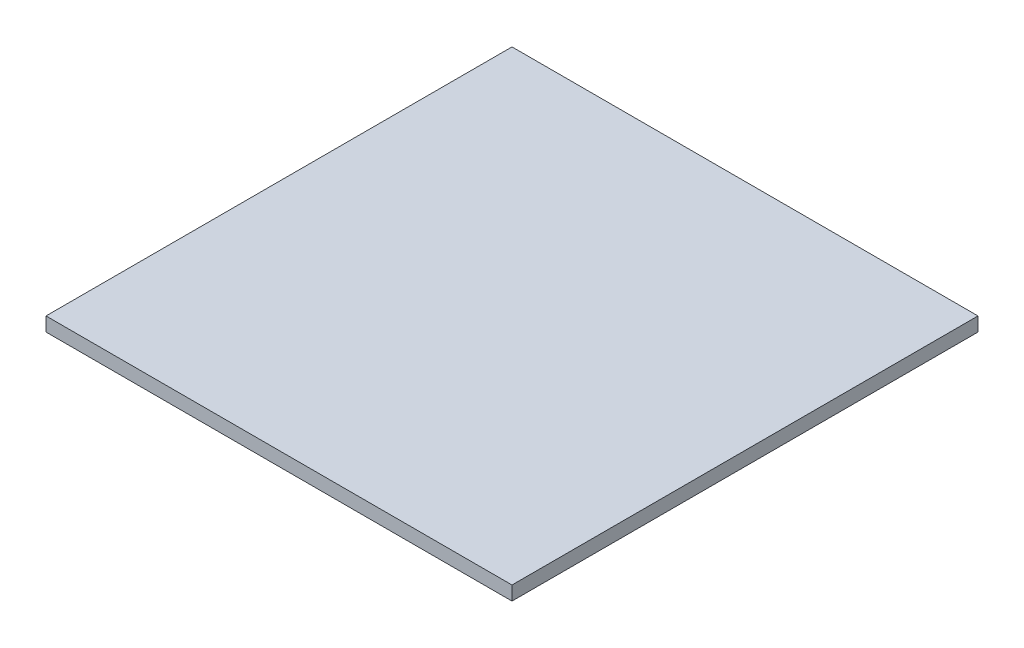
ISO-10303-21;
HEADER;
FILE_DESCRIPTION(('STEP AP214'),'2;1');
FILE_NAME('part.step','',(''),(''),'','','');
FILE_SCHEMA(('AUTOMOTIVE_DESIGN { 1 0 10303 214 1 1 1 1 }'));
ENDSEC;
DATA;
#1=APPLICATION_CONTEXT('core data for automotive mechanical design processes');
#2=APPLICATION_PROTOCOL_DEFINITION('international standard','automotive_design',2000,#1);
#3=PRODUCT_CONTEXT('',#1,'mechanical');
#4=PRODUCT('Part','Part','',(#3));
#5=PRODUCT_RELATED_PRODUCT_CATEGORY('part','',(#4));
#6=PRODUCT_DEFINITION_FORMATION('','',#4);
#7=PRODUCT_DEFINITION_CONTEXT('part definition',#1,'design');
#8=PRODUCT_DEFINITION('design','',#6,#7);
#9=PRODUCT_DEFINITION_SHAPE('','',#8);
#10=(LENGTH_UNIT() NAMED_UNIT(*) SI_UNIT(.MILLI.,.METRE.));
#11=(NAMED_UNIT(*) PLANE_ANGLE_UNIT() SI_UNIT($,.RADIAN.));
#12=(NAMED_UNIT(*) SI_UNIT($,.STERADIAN.) SOLID_ANGLE_UNIT());
#13=UNCERTAINTY_MEASURE_WITH_UNIT(LENGTH_MEASURE(1.E-05),#10,'distance_accuracy_value','');
#14=(GEOMETRIC_REPRESENTATION_CONTEXT(3) GLOBAL_UNCERTAINTY_ASSIGNED_CONTEXT((#13)) GLOBAL_UNIT_ASSIGNED_CONTEXT((#10,
#11,#12)) REPRESENTATION_CONTEXT('',''));
#15=CARTESIAN_POINT('',(0.,0.,0.));
#16=DIRECTION('',(0.,0.,1.));
#17=DIRECTION('',(1.,0.,0.));
#18=AXIS2_PLACEMENT_3D('',#15,#16,#17);
#19=CARTESIAN_POINT('',(-50.,3.,50.));
#20=DIRECTION('',(1.,0.,0.));
#21=DIRECTION('',(0.,0.,-1.));
#22=AXIS2_PLACEMENT_3D('',#19,#20,#21);
#23=PLANE('',#22);
#24=DIRECTION('',(0.,0.,1.));
#25=VECTOR('',#24,1.);
#26=CARTESIAN_POINT('',(-50.,0.,50.));
#27=LINE('',#26,#25);
#28=CARTESIAN_POINT('',(-50.,0.,-50.));
#29=VERTEX_POINT('',#28);
#30=CARTESIAN_POINT('',(-50.,0.,50.));
#31=VERTEX_POINT('',#30);
#32=EDGE_CURVE('E100',#29,#31,#27,.T.);
#33=ORIENTED_EDGE('',*,*,#32,.T.);
#34=DIRECTION('',(0.,-1.,0.));
#35=VECTOR('',#34,1.);
#36=CARTESIAN_POINT('',(-50.,3.,50.));
#37=LINE('',#36,#35);
#38=CARTESIAN_POINT('',(-50.,3.,50.));
#39=VERTEX_POINT('',#38);
#40=EDGE_CURVE('E11',#39,#31,#37,.T.);
#41=ORIENTED_EDGE('',*,*,#40,.F.);
#42=DIRECTION('',(0.,0.,1.));
#43=VECTOR('',#42,1.);
#44=CARTESIAN_POINT('',(-50.,3.,50.));
#45=LINE('',#44,#43);
#46=CARTESIAN_POINT('',(-50.,3.,-50.));
#47=VERTEX_POINT('',#46);
#48=EDGE_CURVE('E88',#47,#39,#45,.T.);
#49=ORIENTED_EDGE('',*,*,#48,.F.);
#50=DIRECTION('',(0.,-1.,0.));
#51=VECTOR('',#50,1.);
#52=CARTESIAN_POINT('',(-50.,3.,-50.));
#53=LINE('',#52,#51);
#54=EDGE_CURVE('E96',#47,#29,#53,.T.);
#55=ORIENTED_EDGE('',*,*,#54,.T.);
#56=EDGE_LOOP('',(#33,#41,#49,#55));
#57=FACE_BOUND('',#56,.T.);
#58=ADVANCED_FACE('F37',(#57),#23,.F.);
#59=CARTESIAN_POINT('',(50.,3.,50.));
#60=DIRECTION('',(0.,0.,-1.));
#61=DIRECTION('',(-1.,0.,0.));
#62=AXIS2_PLACEMENT_3D('',#59,#60,#61);
#63=PLANE('',#62);
#64=DIRECTION('',(1.,0.,0.));
#65=VECTOR('',#64,1.);
#66=CARTESIAN_POINT('',(50.,0.,50.));
#67=LINE('',#66,#65);
#68=CARTESIAN_POINT('',(50.,0.,50.));
#69=VERTEX_POINT('',#68);
#70=EDGE_CURVE('E92',#31,#69,#67,.T.);
#71=ORIENTED_EDGE('',*,*,#70,.T.);
#72=DIRECTION('',(0.,-1.,0.));
#73=VECTOR('',#72,1.);
#74=CARTESIAN_POINT('',(50.,3.,50.));
#75=LINE('',#74,#73);
#76=CARTESIAN_POINT('',(50.,3.,50.));
#77=VERTEX_POINT('',#76);
#78=EDGE_CURVE('E45',#77,#69,#75,.T.);
#79=ORIENTED_EDGE('',*,*,#78,.F.);
#80=DIRECTION('',(1.,0.,0.));
#81=VECTOR('',#80,1.);
#82=CARTESIAN_POINT('',(50.,3.,50.));
#83=LINE('',#82,#81);
#84=EDGE_CURVE('E83',#39,#77,#83,.T.);
#85=ORIENTED_EDGE('',*,*,#84,.F.);
#86=ORIENTED_EDGE('',*,*,#40,.T.);
#87=EDGE_LOOP('',(#71,#79,#85,#86));
#88=FACE_BOUND('',#87,.T.);
#89=ADVANCED_FACE('F91',(#88),#63,.F.);
#90=CARTESIAN_POINT('',(50.,3.,50.));
#91=DIRECTION('',(-1.,0.,0.));
#92=DIRECTION('',(0.,0.,1.));
#93=AXIS2_PLACEMENT_3D('',#90,#91,#92);
#94=PLANE('',#93);
#95=DIRECTION('',(0.,0.,-1.));
#96=VECTOR('',#95,1.);
#97=CARTESIAN_POINT('',(50.,0.,50.));
#98=LINE('',#97,#96);
#99=CARTESIAN_POINT('',(50.,0.,-50.));
#100=VERTEX_POINT('',#99);
#101=EDGE_CURVE('E70',#69,#100,#98,.T.);
#102=ORIENTED_EDGE('',*,*,#101,.T.);
#103=DIRECTION('',(0.,-1.,0.));
#104=VECTOR('',#103,1.);
#105=CARTESIAN_POINT('',(50.,3.,-50.));
#106=LINE('',#105,#104);
#107=CARTESIAN_POINT('',(50.,3.,-50.));
#108=VERTEX_POINT('',#107);
#109=EDGE_CURVE('E93',#108,#100,#106,.T.);
#110=ORIENTED_EDGE('',*,*,#109,.F.);
#111=DIRECTION('',(0.,0.,-1.));
#112=VECTOR('',#111,1.);
#113=CARTESIAN_POINT('',(50.,3.,50.));
#114=LINE('',#113,#112);
#115=EDGE_CURVE('E86',#77,#108,#114,.T.);
#116=ORIENTED_EDGE('',*,*,#115,.F.);
#117=ORIENTED_EDGE('',*,*,#78,.T.);
#118=EDGE_LOOP('',(#102,#110,#116,#117));
#119=FACE_BOUND('',#118,.T.);
#120=ADVANCED_FACE('F94',(#119),#94,.F.);
#121=CARTESIAN_POINT('',(50.,3.,-50.));
#122=DIRECTION('',(0.,0.,1.));
#123=DIRECTION('',(1.,0.,0.));
#124=AXIS2_PLACEMENT_3D('',#121,#122,#123);
#125=PLANE('',#124);
#126=DIRECTION('',(-1.,0.,0.));
#127=VECTOR('',#126,1.);
#128=CARTESIAN_POINT('',(50.,0.,-50.));
#129=LINE('',#128,#127);
#130=EDGE_CURVE('E76',#100,#29,#129,.T.);
#131=ORIENTED_EDGE('',*,*,#130,.T.);
#132=ORIENTED_EDGE('',*,*,#54,.F.);
#133=DIRECTION('',(-1.,0.,0.));
#134=VECTOR('',#133,1.);
#135=CARTESIAN_POINT('',(50.,3.,-50.));
#136=LINE('',#135,#134);
#137=EDGE_CURVE('E53',#108,#47,#136,.T.);
#138=ORIENTED_EDGE('',*,*,#137,.F.);
#139=ORIENTED_EDGE('',*,*,#109,.T.);
#140=EDGE_LOOP('',(#131,#132,#138,#139));
#141=FACE_BOUND('',#140,.T.);
#142=ADVANCED_FACE('F107',(#141),#125,.F.);
#143=CARTESIAN_POINT('',(0.,3.,0.));
#144=DIRECTION('',(0.,1.,0.));
#145=DIRECTION('',(0.,0.,1.));
#146=AXIS2_PLACEMENT_3D('',#143,#144,#145);
#147=PLANE('',#146);
#148=ORIENTED_EDGE('',*,*,#48,.T.);
#149=ORIENTED_EDGE('',*,*,#84,.T.);
#150=ORIENTED_EDGE('',*,*,#115,.T.);
#151=ORIENTED_EDGE('',*,*,#137,.T.);
#152=EDGE_LOOP('',(#148,#149,#150,#151));
#153=FACE_BOUND('',#152,.T.);
#154=ADVANCED_FACE('F84',(#153),#147,.T.);
#155=CARTESIAN_POINT('',(0.,0.,0.));
#156=DIRECTION('',(0.,1.,0.));
#157=DIRECTION('',(0.,0.,1.));
#158=AXIS2_PLACEMENT_3D('',#155,#156,#157);
#159=PLANE('',#158);
#160=ORIENTED_EDGE('',*,*,#32,.F.);
#161=ORIENTED_EDGE('',*,*,#130,.F.);
#162=ORIENTED_EDGE('',*,*,#101,.F.);
#163=ORIENTED_EDGE('',*,*,#70,.F.);
#164=EDGE_LOOP('',(#160,#161,#162,#163));
#165=FACE_BOUND('',#164,.T.);
#166=ADVANCED_FACE('F110',(#165),#159,.F.);
#167=CLOSED_SHELL('',(#58,#89,#120,#142,#154,#166));
#168=MANIFOLD_SOLID_BREP('B2',#167);
#169=ADVANCED_BREP_SHAPE_REPRESENTATION('',(#18,#168),#14);
#170=SHAPE_DEFINITION_REPRESENTATION(#9,#169);
ENDSEC;
END-ISO-10303-21;
